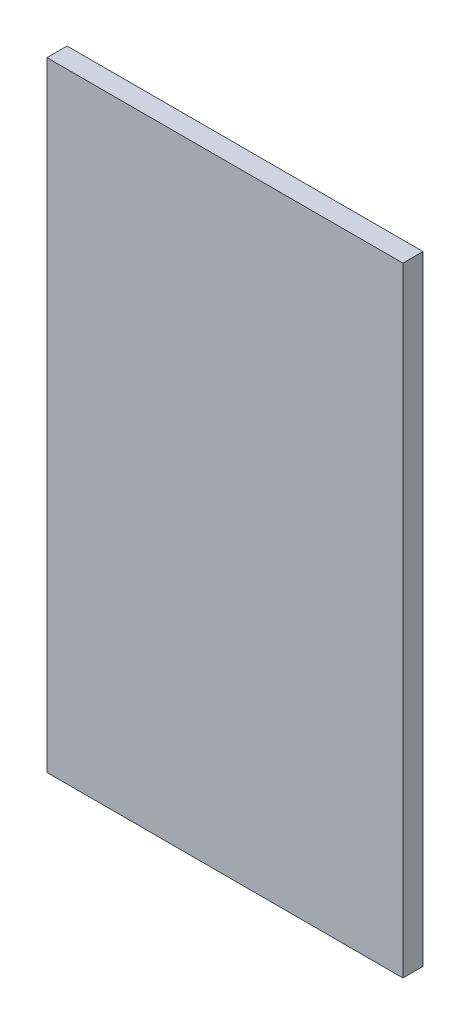
ISO-10303-21;
HEADER;
FILE_DESCRIPTION(('STEP AP214'),'2;1');
FILE_NAME('part.step','',(''),(''),'','','');
FILE_SCHEMA(('AUTOMOTIVE_DESIGN { 1 0 10303 214 1 1 1 1 }'));
ENDSEC;
DATA;
#1=APPLICATION_CONTEXT('core data for automotive mechanical design processes');
#2=APPLICATION_PROTOCOL_DEFINITION('international standard','automotive_design',2000,#1);
#3=PRODUCT_CONTEXT('',#1,'mechanical');
#4=PRODUCT('Part','Part','',(#3));
#5=PRODUCT_RELATED_PRODUCT_CATEGORY('part','',(#4));
#6=PRODUCT_DEFINITION_FORMATION('','',#4);
#7=PRODUCT_DEFINITION_CONTEXT('part definition',#1,'design');
#8=PRODUCT_DEFINITION('design','',#6,#7);
#9=PRODUCT_DEFINITION_SHAPE('','',#8);
#10=(LENGTH_UNIT() NAMED_UNIT(*) SI_UNIT(.MILLI.,.METRE.));
#11=(NAMED_UNIT(*) PLANE_ANGLE_UNIT() SI_UNIT($,.RADIAN.));
#12=(NAMED_UNIT(*) SI_UNIT($,.STERADIAN.) SOLID_ANGLE_UNIT());
#13=UNCERTAINTY_MEASURE_WITH_UNIT(LENGTH_MEASURE(1.E-05),#10,'distance_accuracy_value','');
#14=(GEOMETRIC_REPRESENTATION_CONTEXT(3) GLOBAL_UNCERTAINTY_ASSIGNED_CONTEXT((#13)) GLOBAL_UNIT_ASSIGNED_CONTEXT((#10,
#11,#12)) REPRESENTATION_CONTEXT('',''));
#15=CARTESIAN_POINT('',(0.,0.,0.));
#16=DIRECTION('',(0.,0.,1.));
#17=DIRECTION('',(1.,0.,0.));
#18=AXIS2_PLACEMENT_3D('',#15,#16,#17);
#19=CARTESIAN_POINT('',(-115.,200.,13.));
#20=DIRECTION('',(1.,0.,0.));
#21=DIRECTION('',(0.,1.,0.));
#22=AXIS2_PLACEMENT_3D('',#19,#20,#21);
#23=PLANE('',#22);
#24=DIRECTION('',(0.,-1.,0.));
#25=VECTOR('',#24,1.);
#26=CARTESIAN_POINT('',(-115.,200.,0.));
#27=LINE('',#26,#25);
#28=CARTESIAN_POINT('',(-115.,200.,0.));
#29=VERTEX_POINT('',#28);
#30=CARTESIAN_POINT('',(-115.,-200.,0.));
#31=VERTEX_POINT('',#30);
#32=EDGE_CURVE('E107',#29,#31,#27,.T.);
#33=ORIENTED_EDGE('',*,*,#32,.T.);
#34=DIRECTION('',(0.,0.,-1.));
#35=VECTOR('',#34,1.);
#36=CARTESIAN_POINT('',(-115.,-200.,13.));
#37=LINE('',#36,#35);
#38=CARTESIAN_POINT('',(-115.,-200.,13.));
#39=VERTEX_POINT('',#38);
#40=EDGE_CURVE('E11',#39,#31,#37,.T.);
#41=ORIENTED_EDGE('',*,*,#40,.F.);
#42=DIRECTION('',(0.,-1.,0.));
#43=VECTOR('',#42,1.);
#44=CARTESIAN_POINT('',(-115.,200.,13.));
#45=LINE('',#44,#43);
#46=CARTESIAN_POINT('',(-115.,200.,13.));
#47=VERTEX_POINT('',#46);
#48=EDGE_CURVE('E91',#47,#39,#45,.T.);
#49=ORIENTED_EDGE('',*,*,#48,.F.);
#50=DIRECTION('',(0.,0.,-1.));
#51=VECTOR('',#50,1.);
#52=CARTESIAN_POINT('',(-115.,200.,13.));
#53=LINE('',#52,#51);
#54=EDGE_CURVE('E103',#47,#29,#53,.T.);
#55=ORIENTED_EDGE('',*,*,#54,.T.);
#56=EDGE_LOOP('',(#33,#41,#49,#55));
#57=FACE_BOUND('',#56,.T.);
#58=ADVANCED_FACE('F39',(#57),#23,.F.);
#59=CARTESIAN_POINT('',(115.,-200.,13.));
#60=DIRECTION('',(0.,1.,0.));
#61=DIRECTION('',(-1.,0.,0.));
#62=AXIS2_PLACEMENT_3D('',#59,#60,#61);
#63=PLANE('',#62);
#64=DIRECTION('',(1.,0.,0.));
#65=VECTOR('',#64,1.);
#66=CARTESIAN_POINT('',(115.,-200.,0.));
#67=LINE('',#66,#65);
#68=CARTESIAN_POINT('',(115.,-200.,0.));
#69=VERTEX_POINT('',#68);
#70=EDGE_CURVE('E96',#31,#69,#67,.T.);
#71=ORIENTED_EDGE('',*,*,#70,.T.);
#72=DIRECTION('',(0.,0.,-1.));
#73=VECTOR('',#72,1.);
#74=CARTESIAN_POINT('',(115.,-200.,13.));
#75=LINE('',#74,#73);
#76=CARTESIAN_POINT('',(115.,-200.,13.));
#77=VERTEX_POINT('',#76);
#78=EDGE_CURVE('E48',#77,#69,#75,.T.);
#79=ORIENTED_EDGE('',*,*,#78,.F.);
#80=DIRECTION('',(1.,0.,0.));
#81=VECTOR('',#80,1.);
#82=CARTESIAN_POINT('',(115.,-200.,13.));
#83=LINE('',#82,#81);
#84=EDGE_CURVE('E86',#39,#77,#83,.T.);
#85=ORIENTED_EDGE('',*,*,#84,.F.);
#86=ORIENTED_EDGE('',*,*,#40,.T.);
#87=EDGE_LOOP('',(#71,#79,#85,#86));
#88=FACE_BOUND('',#87,.T.);
#89=ADVANCED_FACE('F95',(#88),#63,.F.);
#90=CARTESIAN_POINT('',(115.,200.,13.));
#91=DIRECTION('',(-1.,0.,0.));
#92=DIRECTION('',(0.,-1.,0.));
#93=AXIS2_PLACEMENT_3D('',#90,#91,#92);
#94=PLANE('',#93);
#95=DIRECTION('',(0.,1.,0.));
#96=VECTOR('',#95,1.);
#97=CARTESIAN_POINT('',(115.,200.,0.));
#98=LINE('',#97,#96);
#99=CARTESIAN_POINT('',(115.,200.,0.));
#100=VERTEX_POINT('',#99);
#101=EDGE_CURVE('E73',#69,#100,#98,.T.);
#102=ORIENTED_EDGE('',*,*,#101,.T.);
#103=DIRECTION('',(0.,0.,-1.));
#104=VECTOR('',#103,1.);
#105=CARTESIAN_POINT('',(115.,200.,13.));
#106=LINE('',#105,#104);
#107=CARTESIAN_POINT('',(115.,200.,13.));
#108=VERTEX_POINT('',#107);
#109=EDGE_CURVE('E98',#108,#100,#106,.T.);
#110=ORIENTED_EDGE('',*,*,#109,.F.);
#111=DIRECTION('',(0.,1.,0.));
#112=VECTOR('',#111,1.);
#113=CARTESIAN_POINT('',(115.,200.,13.));
#114=LINE('',#113,#112);
#115=EDGE_CURVE('E89',#77,#108,#114,.T.);
#116=ORIENTED_EDGE('',*,*,#115,.F.);
#117=ORIENTED_EDGE('',*,*,#78,.T.);
#118=EDGE_LOOP('',(#102,#110,#116,#117));
#119=FACE_BOUND('',#118,.T.);
#120=ADVANCED_FACE('F99',(#119),#94,.F.);
#121=CARTESIAN_POINT('',(115.,200.,13.));
#122=DIRECTION('',(0.,-1.,0.));
#123=DIRECTION('',(1.,0.,0.));
#124=AXIS2_PLACEMENT_3D('',#121,#122,#123);
#125=PLANE('',#124);
#126=DIRECTION('',(-1.,0.,0.));
#127=VECTOR('',#126,1.);
#128=CARTESIAN_POINT('',(115.,200.,0.));
#129=LINE('',#128,#127);
#130=EDGE_CURVE('E79',#100,#29,#129,.T.);
#131=ORIENTED_EDGE('',*,*,#130,.T.);
#132=ORIENTED_EDGE('',*,*,#54,.F.);
#133=DIRECTION('',(-1.,0.,0.));
#134=VECTOR('',#133,1.);
#135=CARTESIAN_POINT('',(115.,200.,13.));
#136=LINE('',#135,#134);
#137=EDGE_CURVE('E56',#108,#47,#136,.T.);
#138=ORIENTED_EDGE('',*,*,#137,.F.);
#139=ORIENTED_EDGE('',*,*,#109,.T.);
#140=EDGE_LOOP('',(#131,#132,#138,#139));
#141=FACE_BOUND('',#140,.T.);
#142=ADVANCED_FACE('F120',(#141),#125,.F.);
#143=CARTESIAN_POINT('',(0.,0.,13.));
#144=DIRECTION('',(0.,0.,-1.));
#145=DIRECTION('',(-1.,0.,0.));
#146=AXIS2_PLACEMENT_3D('',#143,#144,#145);
#147=PLANE('',#146);
#148=ORIENTED_EDGE('',*,*,#48,.T.);
#149=ORIENTED_EDGE('',*,*,#84,.T.);
#150=ORIENTED_EDGE('',*,*,#115,.T.);
#151=ORIENTED_EDGE('',*,*,#137,.T.);
#152=EDGE_LOOP('',(#148,#149,#150,#151));
#153=FACE_BOUND('',#152,.T.);
#154=ADVANCED_FACE('F87',(#153),#147,.F.);
#155=CARTESIAN_POINT('',(0.,0.,0.));
#156=DIRECTION('',(0.,0.,-1.));
#157=DIRECTION('',(-1.,0.,0.));
#158=AXIS2_PLACEMENT_3D('',#155,#156,#157);
#159=PLANE('',#158);
#160=ORIENTED_EDGE('',*,*,#32,.F.);
#161=ORIENTED_EDGE('',*,*,#130,.F.);
#162=ORIENTED_EDGE('',*,*,#101,.F.);
#163=ORIENTED_EDGE('',*,*,#70,.F.);
#164=EDGE_LOOP('',(#160,#161,#162,#163));
#165=FACE_BOUND('',#164,.T.);
#166=ADVANCED_FACE('F123',(#165),#159,.T.);
#167=CLOSED_SHELL('',(#58,#89,#120,#142,#154,#166));
#168=MANIFOLD_SOLID_BREP('B2',#167);
#169=ADVANCED_BREP_SHAPE_REPRESENTATION('',(#18,#168),#14);
#170=SHAPE_DEFINITION_REPRESENTATION(#9,#169);
ENDSEC;
END-ISO-10303-21;
